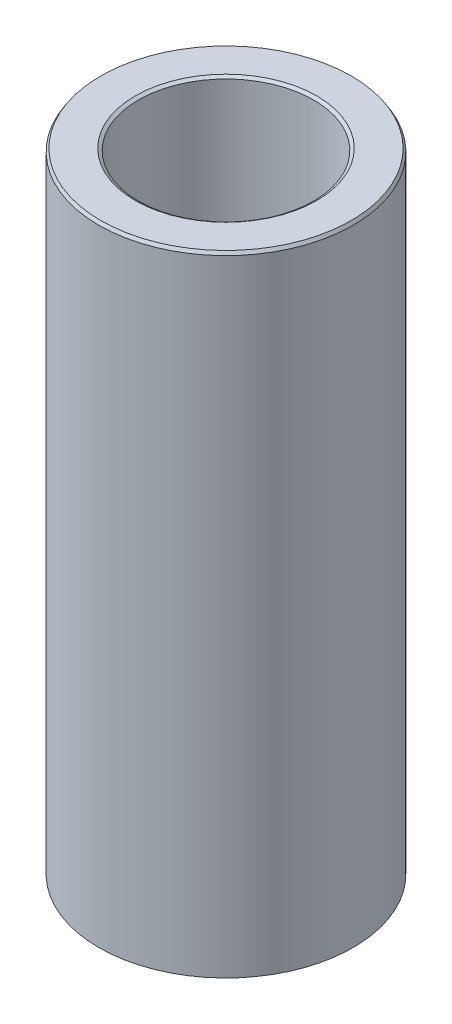
ISO-10303-21;
HEADER;
FILE_DESCRIPTION(('STEP AP214'),'2;1');
FILE_NAME('part.step','',(''),(''),'','','');
FILE_SCHEMA(('AUTOMOTIVE_DESIGN { 1 0 10303 214 1 1 1 1 }'));
ENDSEC;
DATA;
#1=APPLICATION_CONTEXT('core data for automotive mechanical design processes');
#2=APPLICATION_PROTOCOL_DEFINITION('international standard','automotive_design',2000,#1);
#3=PRODUCT_CONTEXT('',#1,'mechanical');
#4=PRODUCT('Part','Part','',(#3));
#5=PRODUCT_RELATED_PRODUCT_CATEGORY('part','',(#4));
#6=PRODUCT_DEFINITION_FORMATION('','',#4);
#7=PRODUCT_DEFINITION_CONTEXT('part definition',#1,'design');
#8=PRODUCT_DEFINITION('design','',#6,#7);
#9=PRODUCT_DEFINITION_SHAPE('','',#8);
#10=(LENGTH_UNIT() NAMED_UNIT(*) SI_UNIT(.MILLI.,.METRE.));
#11=(NAMED_UNIT(*) PLANE_ANGLE_UNIT() SI_UNIT($,.RADIAN.));
#12=(NAMED_UNIT(*) SI_UNIT($,.STERADIAN.) SOLID_ANGLE_UNIT());
#13=UNCERTAINTY_MEASURE_WITH_UNIT(LENGTH_MEASURE(1.E-05),#10,'distance_accuracy_value','');
#14=(GEOMETRIC_REPRESENTATION_CONTEXT(3) GLOBAL_UNCERTAINTY_ASSIGNED_CONTEXT((#13)) GLOBAL_UNIT_ASSIGNED_CONTEXT((#10,
#11,#12)) REPRESENTATION_CONTEXT('',''));
#15=CARTESIAN_POINT('',(0.,0.,0.));
#16=DIRECTION('',(0.,0.,1.));
#17=DIRECTION('',(1.,0.,0.));
#18=AXIS2_PLACEMENT_3D('',#15,#16,#17);
#19=CARTESIAN_POINT('',(0.,272.677087324548,0.));
#20=DIRECTION('',(0.,-1.,0.));
#21=DIRECTION('',(0.,0.,-1.));
#22=AXIS2_PLACEMENT_3D('',#19,#20,#21);
#23=CYLINDRICAL_SURFACE('',#22,55.);
#24=CARTESIAN_POINT('',(0.,0.850916116485245,0.));
#25=DIRECTION('',(0.,1.,0.));
#26=DIRECTION('',(0.,0.,1.));
#27=AXIS2_PLACEMENT_3D('',#24,#25,#26);
#28=CIRCLE('',#27,55.);
#29=CARTESIAN_POINT('',(0.,0.850916116485245,55.));
#30=VERTEX_POINT('',#29);
#31=EDGE_CURVE('E10',#30,#30,#28,.T.);
#32=ORIENTED_EDGE('',*,*,#31,.T.);
#33=EDGE_LOOP('',(#32));
#34=FACE_BOUND('',#33,.T.);
#35=CARTESIAN_POINT('',(0.,271.341976499133,0.));
#36=DIRECTION('',(0.,1.,0.));
#37=DIRECTION('',(0.,0.,1.));
#38=AXIS2_PLACEMENT_3D('',#35,#36,#37);
#39=CIRCLE('',#38,55.);
#40=CARTESIAN_POINT('',(0.,271.341976499133,55.));
#41=VERTEX_POINT('',#40);
#42=EDGE_CURVE('E50',#41,#41,#39,.F.);
#43=ORIENTED_EDGE('',*,*,#42,.T.);
#44=EDGE_LOOP('',(#43));
#45=FACE_BOUND('',#44,.T.);
#46=ADVANCED_FACE('F39',(#34,#45),#23,.T.);
#47=CARTESIAN_POINT('',(0.,272.677087324548,0.));
#48=DIRECTION('',(0.,1.,0.));
#49=DIRECTION('',(0.,0.,1.));
#50=AXIS2_PLACEMENT_3D('',#47,#48,#49);
#51=PLANE('',#50);
#52=CARTESIAN_POINT('',(0.,272.677087324548,0.));
#53=DIRECTION('',(0.,1.,0.));
#54=DIRECTION('',(0.,0.,1.));
#55=AXIS2_PLACEMENT_3D('',#52,#53,#54);
#56=CIRCLE('',#55,39.2205664369715);
#57=CARTESIAN_POINT('',(0.,272.677087324548,39.2205664369715));
#58=VERTEX_POINT('',#57);
#59=EDGE_CURVE('E58',#58,#58,#56,.F.);
#60=ORIENTED_EDGE('',*,*,#59,.T.);
#61=EDGE_LOOP('',(#60));
#62=FACE_BOUND('',#61,.T.);
#63=CARTESIAN_POINT('',(0.,272.677087324548,0.));
#64=DIRECTION('',(0.,1.,0.));
#65=DIRECTION('',(0.,0.,1.));
#66=AXIS2_PLACEMENT_3D('',#63,#64,#65);
#67=CIRCLE('',#66,54.1490838835148);
#68=CARTESIAN_POINT('',(0.,272.677087324548,54.1490838835148));
#69=VERTEX_POINT('',#68);
#70=EDGE_CURVE('E61',#69,#69,#67,.T.);
#71=ORIENTED_EDGE('',*,*,#70,.T.);
#72=EDGE_LOOP('',(#71));
#73=FACE_BOUND('',#72,.T.);
#74=ADVANCED_FACE('F88',(#62,#73),#51,.T.);
#75=CARTESIAN_POINT('',(0.,0.,0.));
#76=DIRECTION('',(0.,1.,0.));
#77=DIRECTION('',(0.,0.,1.));
#78=AXIS2_PLACEMENT_3D('',#75,#76,#77);
#79=PLANE('',#78);
#80=CARTESIAN_POINT('',(0.,0.,0.));
#81=DIRECTION('',(0.,1.,0.));
#82=DIRECTION('',(0.,0.,1.));
#83=AXIS2_PLACEMENT_3D('',#80,#81,#82);
#84=CIRCLE('',#83,38.7363717280421);
#85=CARTESIAN_POINT('',(0.,0.,38.7363717280421));
#86=VERTEX_POINT('',#85);
#87=EDGE_CURVE('E51',#86,#86,#84,.T.);
#88=ORIENTED_EDGE('',*,*,#87,.T.);
#89=EDGE_LOOP('',(#88));
#90=FACE_BOUND('',#89,.T.);
#91=CARTESIAN_POINT('',(0.,0.,0.));
#92=DIRECTION('',(0.,1.,0.));
#93=DIRECTION('',(0.,0.,1.));
#94=AXIS2_PLACEMENT_3D('',#91,#92,#93);
#95=CIRCLE('',#94,53.6648891745855);
#96=CARTESIAN_POINT('',(0.,0.,53.6648891745855));
#97=VERTEX_POINT('',#96);
#98=EDGE_CURVE('E54',#97,#97,#95,.F.);
#99=ORIENTED_EDGE('',*,*,#98,.T.);
#100=EDGE_LOOP('',(#99));
#101=FACE_BOUND('',#100,.T.);
#102=ADVANCED_FACE('F83',(#90,#101),#79,.F.);
#103=CARTESIAN_POINT('',(0.,272.677087324548,0.));
#104=DIRECTION('',(0.,-1.,0.));
#105=DIRECTION('',(0.,0.,-1.));
#106=AXIS2_PLACEMENT_3D('',#103,#104,#105);
#107=CYLINDRICAL_SURFACE('',#106,37.8854556115569);
#108=CARTESIAN_POINT('',(0.,271.826171208062,0.));
#109=DIRECTION('',(0.,1.,0.));
#110=DIRECTION('',(0.,0.,1.));
#111=AXIS2_PLACEMENT_3D('',#108,#109,#110);
#112=CIRCLE('',#111,37.8854556115569);
#113=CARTESIAN_POINT('',(0.,271.826171208062,37.8854556115569));
#114=VERTEX_POINT('',#113);
#115=EDGE_CURVE('E67',#114,#114,#112,.T.);
#116=ORIENTED_EDGE('',*,*,#115,.T.);
#117=EDGE_LOOP('',(#116));
#118=FACE_BOUND('',#117,.T.);
#119=CARTESIAN_POINT('',(0.,1.33511082541449,0.));
#120=DIRECTION('',(0.,1.,0.));
#121=DIRECTION('',(0.,0.,1.));
#122=AXIS2_PLACEMENT_3D('',#119,#120,#121);
#123=CIRCLE('',#122,37.8854556115569);
#124=CARTESIAN_POINT('',(0.,1.33511082541449,37.8854556115569));
#125=VERTEX_POINT('',#124);
#126=EDGE_CURVE('E69',#125,#125,#123,.F.);
#127=ORIENTED_EDGE('',*,*,#126,.T.);
#128=EDGE_LOOP('',(#127));
#129=FACE_BOUND('',#128,.T.);
#130=ADVANCED_FACE('F71',(#118,#129),#107,.F.);
#131=CARTESIAN_POINT('',(0.,271.826171208062,0.));
#132=DIRECTION('',(0.,1.,0.));
#133=DIRECTION('',(0.,0.,1.));
#134=AXIS2_PLACEMENT_3D('',#131,#132,#133);
#135=CONICAL_SURFACE('',#134,37.8854556115569,1.0033742954277);
#136=ORIENTED_EDGE('',*,*,#59,.F.);
#137=EDGE_LOOP('',(#136));
#138=FACE_BOUND('',#137,.T.);
#139=ORIENTED_EDGE('',*,*,#115,.F.);
#140=EDGE_LOOP('',(#139));
#141=FACE_BOUND('',#140,.T.);
#142=ADVANCED_FACE('F77',(#138,#141),#135,.F.);
#143=CARTESIAN_POINT('',(0.,0.,0.));
#144=DIRECTION('',(0.,-1.,0.));
#145=DIRECTION('',(0.,0.,-1.));
#146=AXIS2_PLACEMENT_3D('',#143,#144,#145);
#147=CONICAL_SURFACE('',#146,38.7363717280421,0.56742203136723);
#148=ORIENTED_EDGE('',*,*,#126,.F.);
#149=EDGE_LOOP('',(#148));
#150=FACE_BOUND('',#149,.T.);
#151=ORIENTED_EDGE('',*,*,#87,.F.);
#152=EDGE_LOOP('',(#151));
#153=FACE_BOUND('',#152,.T.);
#154=ADVANCED_FACE('F73',(#150,#153),#147,.F.);
#155=CARTESIAN_POINT('',(0.,0.850916116485245,0.));
#156=DIRECTION('',(0.,1.,0.));
#157=DIRECTION('',(0.,0.,1.));
#158=AXIS2_PLACEMENT_3D('',#155,#156,#157);
#159=CONICAL_SURFACE('',#158,55.,1.00337429542767);
#160=ORIENTED_EDGE('',*,*,#98,.F.);
#161=EDGE_LOOP('',(#160));
#162=FACE_BOUND('',#161,.T.);
#163=ORIENTED_EDGE('',*,*,#31,.F.);
#164=EDGE_LOOP('',(#163));
#165=FACE_BOUND('',#164,.T.);
#166=ADVANCED_FACE('F76',(#162,#165),#159,.T.);
#167=CARTESIAN_POINT('',(0.,272.677087324548,0.));
#168=DIRECTION('',(0.,-1.,0.));
#169=DIRECTION('',(0.,0.,-1.));
#170=AXIS2_PLACEMENT_3D('',#167,#168,#169);
#171=CONICAL_SURFACE('',#170,54.1490838835148,0.567422031367222);
#172=ORIENTED_EDGE('',*,*,#42,.F.);
#173=EDGE_LOOP('',(#172));
#174=FACE_BOUND('',#173,.T.);
#175=ORIENTED_EDGE('',*,*,#70,.F.);
#176=EDGE_LOOP('',(#175));
#177=FACE_BOUND('',#176,.T.);
#178=ADVANCED_FACE('F45',(#174,#177),#171,.T.);
#179=CLOSED_SHELL('',(#46,#74,#102,#130,#142,#154,#166,#178));
#180=MANIFOLD_SOLID_BREP('B2',#179);
#181=ADVANCED_BREP_SHAPE_REPRESENTATION('',(#18,#180),#14);
#182=SHAPE_DEFINITION_REPRESENTATION(#9,#181);
ENDSEC;
END-ISO-10303-21;
